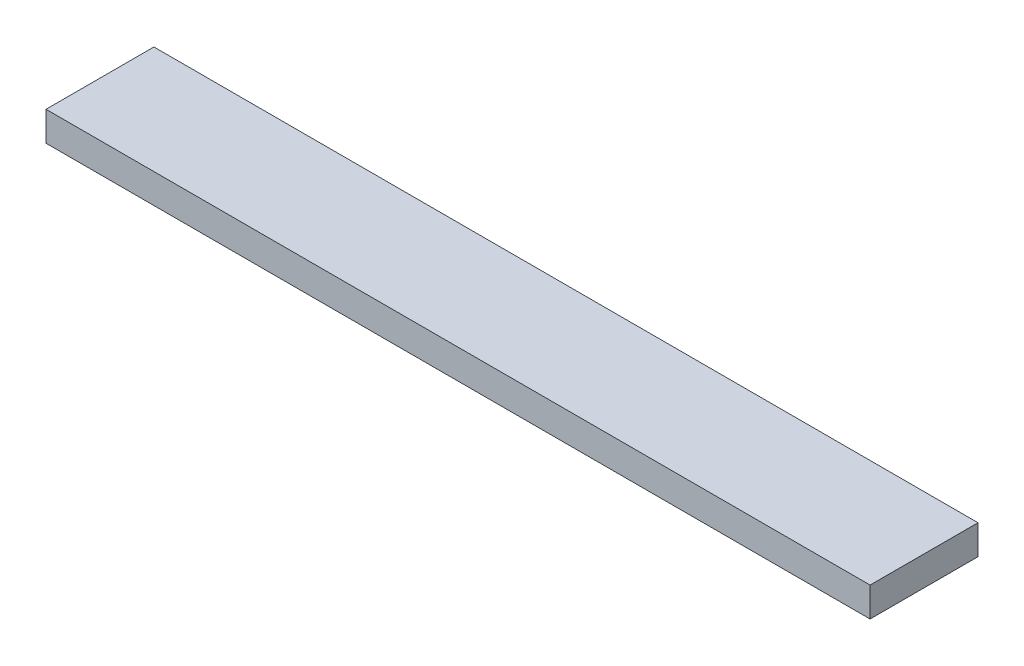
ISO-10303-21;
HEADER;
FILE_DESCRIPTION(('STEP AP214'),'2;1');
FILE_NAME('part.step','',(''),(''),'','','');
FILE_SCHEMA(('AUTOMOTIVE_DESIGN { 1 0 10303 214 1 1 1 1 }'));
ENDSEC;
DATA;
#1=APPLICATION_CONTEXT('core data for automotive mechanical design processes');
#2=APPLICATION_PROTOCOL_DEFINITION('international standard','automotive_design',2000,#1);
#3=PRODUCT_CONTEXT('',#1,'mechanical');
#4=PRODUCT('Part','Part','',(#3));
#5=PRODUCT_RELATED_PRODUCT_CATEGORY('part','',(#4));
#6=PRODUCT_DEFINITION_FORMATION('','',#4);
#7=PRODUCT_DEFINITION_CONTEXT('part definition',#1,'design');
#8=PRODUCT_DEFINITION('design','',#6,#7);
#9=PRODUCT_DEFINITION_SHAPE('','',#8);
#10=(LENGTH_UNIT() NAMED_UNIT(*) SI_UNIT(.MILLI.,.METRE.));
#11=(NAMED_UNIT(*) PLANE_ANGLE_UNIT() SI_UNIT($,.RADIAN.));
#12=(NAMED_UNIT(*) SI_UNIT($,.STERADIAN.) SOLID_ANGLE_UNIT());
#13=UNCERTAINTY_MEASURE_WITH_UNIT(LENGTH_MEASURE(1.E-05),#10,'distance_accuracy_value','');
#14=(GEOMETRIC_REPRESENTATION_CONTEXT(3) GLOBAL_UNCERTAINTY_ASSIGNED_CONTEXT((#13)) GLOBAL_UNIT_ASSIGNED_CONTEXT((#10,
#11,#12)) REPRESENTATION_CONTEXT('',''));
#15=CARTESIAN_POINT('',(0.,0.,0.));
#16=DIRECTION('',(0.,0.,1.));
#17=DIRECTION('',(1.,0.,0.));
#18=AXIS2_PLACEMENT_3D('',#15,#16,#17);
#19=CARTESIAN_POINT('',(0.,38.1,0.));
#20=DIRECTION('',(1.,0.,0.));
#21=DIRECTION('',(0.,0.,-1.));
#22=AXIS2_PLACEMENT_3D('',#19,#20,#21);
#23=PLANE('',#22);
#24=DIRECTION('',(0.,0.,1.));
#25=VECTOR('',#24,1.);
#26=CARTESIAN_POINT('',(0.,0.,0.));
#27=LINE('',#26,#25);
#28=CARTESIAN_POINT('',(0.,0.,-139.7));
#29=VERTEX_POINT('',#28);
#30=CARTESIAN_POINT('',(0.,0.,0.));
#31=VERTEX_POINT('',#30);
#32=EDGE_CURVE('E93',#29,#31,#27,.T.);
#33=ORIENTED_EDGE('',*,*,#32,.T.);
#34=DIRECTION('',(0.,-1.,0.));
#35=VECTOR('',#34,1.);
#36=CARTESIAN_POINT('',(0.,38.1,0.));
#37=LINE('',#36,#35);
#38=CARTESIAN_POINT('',(0.,38.1,0.));
#39=VERTEX_POINT('',#38);
#40=EDGE_CURVE('E11',#39,#31,#37,.T.);
#41=ORIENTED_EDGE('',*,*,#40,.F.);
#42=DIRECTION('',(0.,0.,1.));
#43=VECTOR('',#42,1.);
#44=CARTESIAN_POINT('',(0.,38.1,0.));
#45=LINE('',#44,#43);
#46=CARTESIAN_POINT('',(0.,38.1,-139.7));
#47=VERTEX_POINT('',#46);
#48=EDGE_CURVE('E81',#47,#39,#45,.T.);
#49=ORIENTED_EDGE('',*,*,#48,.F.);
#50=DIRECTION('',(0.,-1.,0.));
#51=VECTOR('',#50,1.);
#52=CARTESIAN_POINT('',(0.,38.1,-139.7));
#53=LINE('',#52,#51);
#54=EDGE_CURVE('E89',#47,#29,#53,.T.);
#55=ORIENTED_EDGE('',*,*,#54,.T.);
#56=EDGE_LOOP('',(#33,#41,#49,#55));
#57=FACE_BOUND('',#56,.T.);
#58=ADVANCED_FACE('F30',(#57),#23,.F.);
#59=CARTESIAN_POINT('',(0.,38.1,0.));
#60=DIRECTION('',(0.,0.,-1.));
#61=DIRECTION('',(-1.,0.,0.));
#62=AXIS2_PLACEMENT_3D('',#59,#60,#61);
#63=PLANE('',#62);
#64=DIRECTION('',(1.,0.,0.));
#65=VECTOR('',#64,1.);
#66=CARTESIAN_POINT('',(0.,0.,0.));
#67=LINE('',#66,#65);
#68=CARTESIAN_POINT('',(1066.8,0.,0.));
#69=VERTEX_POINT('',#68);
#70=EDGE_CURVE('E85',#31,#69,#67,.T.);
#71=ORIENTED_EDGE('',*,*,#70,.T.);
#72=DIRECTION('',(0.,-1.,0.));
#73=VECTOR('',#72,1.);
#74=CARTESIAN_POINT('',(1066.8,38.1,0.));
#75=LINE('',#74,#73);
#76=CARTESIAN_POINT('',(1066.8,38.1,0.));
#77=VERTEX_POINT('',#76);
#78=EDGE_CURVE('E38',#77,#69,#75,.T.);
#79=ORIENTED_EDGE('',*,*,#78,.F.);
#80=DIRECTION('',(1.,0.,0.));
#81=VECTOR('',#80,1.);
#82=CARTESIAN_POINT('',(0.,38.1,0.));
#83=LINE('',#82,#81);
#84=EDGE_CURVE('E76',#39,#77,#83,.T.);
#85=ORIENTED_EDGE('',*,*,#84,.F.);
#86=ORIENTED_EDGE('',*,*,#40,.T.);
#87=EDGE_LOOP('',(#71,#79,#85,#86));
#88=FACE_BOUND('',#87,.T.);
#89=ADVANCED_FACE('F84',(#88),#63,.F.);
#90=CARTESIAN_POINT('',(1066.8,38.1,0.));
#91=DIRECTION('',(-1.,0.,0.));
#92=DIRECTION('',(0.,0.,1.));
#93=AXIS2_PLACEMENT_3D('',#90,#91,#92);
#94=PLANE('',#93);
#95=DIRECTION('',(0.,0.,-1.));
#96=VECTOR('',#95,1.);
#97=CARTESIAN_POINT('',(1066.8,0.,0.));
#98=LINE('',#97,#96);
#99=CARTESIAN_POINT('',(1066.8,0.,-139.7));
#100=VERTEX_POINT('',#99);
#101=EDGE_CURVE('E63',#69,#100,#98,.T.);
#102=ORIENTED_EDGE('',*,*,#101,.T.);
#103=DIRECTION('',(0.,-1.,0.));
#104=VECTOR('',#103,1.);
#105=CARTESIAN_POINT('',(1066.8,38.1,-139.7));
#106=LINE('',#105,#104);
#107=CARTESIAN_POINT('',(1066.8,38.1,-139.7));
#108=VERTEX_POINT('',#107);
#109=EDGE_CURVE('E86',#108,#100,#106,.T.);
#110=ORIENTED_EDGE('',*,*,#109,.F.);
#111=DIRECTION('',(0.,0.,-1.));
#112=VECTOR('',#111,1.);
#113=CARTESIAN_POINT('',(1066.8,38.1,0.));
#114=LINE('',#113,#112);
#115=EDGE_CURVE('E79',#77,#108,#114,.T.);
#116=ORIENTED_EDGE('',*,*,#115,.F.);
#117=ORIENTED_EDGE('',*,*,#78,.T.);
#118=EDGE_LOOP('',(#102,#110,#116,#117));
#119=FACE_BOUND('',#118,.T.);
#120=ADVANCED_FACE('F87',(#119),#94,.F.);
#121=CARTESIAN_POINT('',(0.,38.1,-139.7));
#122=DIRECTION('',(0.,0.,1.));
#123=DIRECTION('',(1.,0.,0.));
#124=AXIS2_PLACEMENT_3D('',#121,#122,#123);
#125=PLANE('',#124);
#126=DIRECTION('',(-1.,0.,0.));
#127=VECTOR('',#126,1.);
#128=CARTESIAN_POINT('',(0.,0.,-139.7));
#129=LINE('',#128,#127);
#130=EDGE_CURVE('E69',#100,#29,#129,.T.);
#131=ORIENTED_EDGE('',*,*,#130,.T.);
#132=ORIENTED_EDGE('',*,*,#54,.F.);
#133=DIRECTION('',(-1.,0.,0.));
#134=VECTOR('',#133,1.);
#135=CARTESIAN_POINT('',(0.,38.1,-139.7));
#136=LINE('',#135,#134);
#137=EDGE_CURVE('E46',#108,#47,#136,.T.);
#138=ORIENTED_EDGE('',*,*,#137,.F.);
#139=ORIENTED_EDGE('',*,*,#109,.T.);
#140=EDGE_LOOP('',(#131,#132,#138,#139));
#141=FACE_BOUND('',#140,.T.);
#142=ADVANCED_FACE('F100',(#141),#125,.F.);
#143=CARTESIAN_POINT('',(0.,38.1,-139.7));
#144=DIRECTION('',(0.,-1.,0.));
#145=DIRECTION('',(0.,0.,-1.));
#146=AXIS2_PLACEMENT_3D('',#143,#144,#145);
#147=PLANE('',#146);
#148=ORIENTED_EDGE('',*,*,#48,.T.);
#149=ORIENTED_EDGE('',*,*,#84,.T.);
#150=ORIENTED_EDGE('',*,*,#115,.T.);
#151=ORIENTED_EDGE('',*,*,#137,.T.);
#152=EDGE_LOOP('',(#148,#149,#150,#151));
#153=FACE_BOUND('',#152,.T.);
#154=ADVANCED_FACE('F77',(#153),#147,.F.);
#155=CARTESIAN_POINT('',(0.,0.,-139.7));
#156=DIRECTION('',(0.,-1.,0.));
#157=DIRECTION('',(0.,0.,-1.));
#158=AXIS2_PLACEMENT_3D('',#155,#156,#157);
#159=PLANE('',#158);
#160=ORIENTED_EDGE('',*,*,#32,.F.);
#161=ORIENTED_EDGE('',*,*,#130,.F.);
#162=ORIENTED_EDGE('',*,*,#101,.F.);
#163=ORIENTED_EDGE('',*,*,#70,.F.);
#164=EDGE_LOOP('',(#160,#161,#162,#163));
#165=FACE_BOUND('',#164,.T.);
#166=ADVANCED_FACE('F103',(#165),#159,.T.);
#167=CLOSED_SHELL('',(#58,#89,#120,#142,#154,#166));
#168=MANIFOLD_SOLID_BREP('B2',#167);
#169=ADVANCED_BREP_SHAPE_REPRESENTATION('',(#18,#168),#14);
#170=SHAPE_DEFINITION_REPRESENTATION(#9,#169);
ENDSEC;
END-ISO-10303-21;
